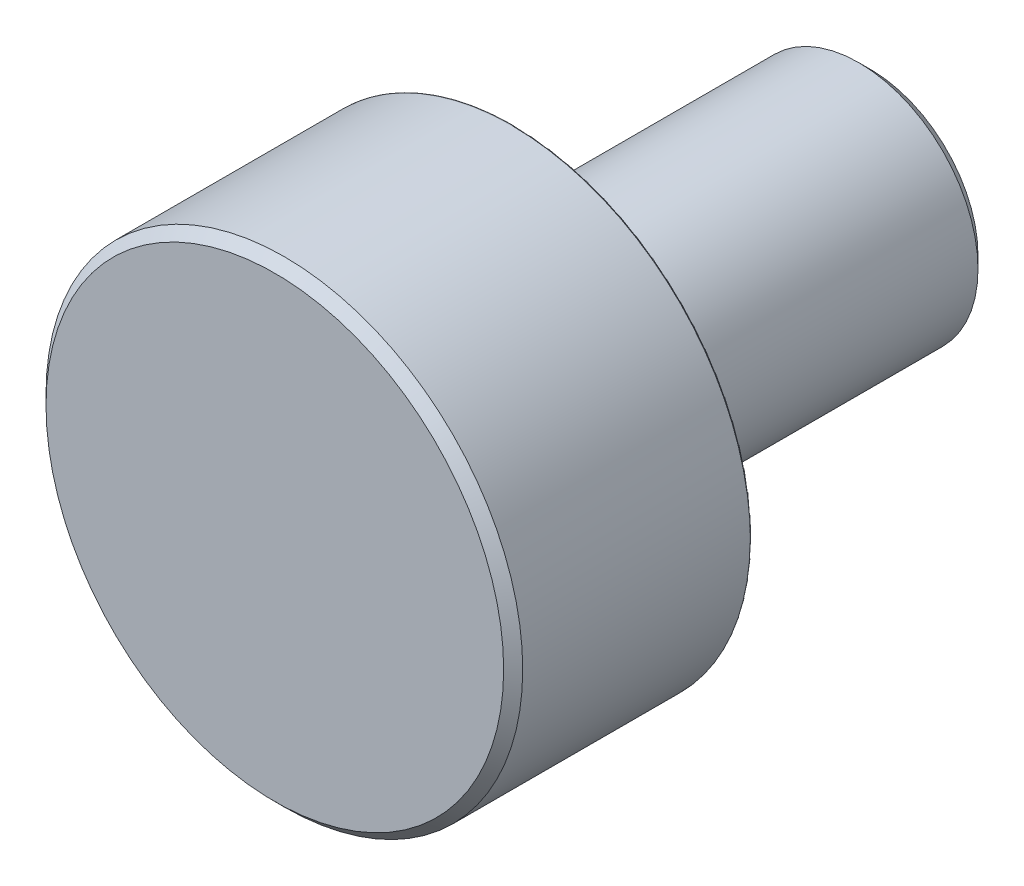
ISO-10303-21;
HEADER;
FILE_DESCRIPTION(('STEP AP214'),'2;1');
FILE_NAME('part.step','',(''),(''),'','','');
FILE_SCHEMA(('AUTOMOTIVE_DESIGN { 1 0 10303 214 1 1 1 1 }'));
ENDSEC;
DATA;
#1=APPLICATION_CONTEXT('core data for automotive mechanical design processes');
#2=APPLICATION_PROTOCOL_DEFINITION('international standard','automotive_design',2000,#1);
#3=PRODUCT_CONTEXT('',#1,'mechanical');
#4=PRODUCT('Part','Part','',(#3));
#5=PRODUCT_RELATED_PRODUCT_CATEGORY('part','',(#4));
#6=PRODUCT_DEFINITION_FORMATION('','',#4);
#7=PRODUCT_DEFINITION_CONTEXT('part definition',#1,'design');
#8=PRODUCT_DEFINITION('design','',#6,#7);
#9=PRODUCT_DEFINITION_SHAPE('','',#8);
#10=(LENGTH_UNIT() NAMED_UNIT(*) SI_UNIT(.MILLI.,.METRE.));
#11=(NAMED_UNIT(*) PLANE_ANGLE_UNIT() SI_UNIT($,.RADIAN.));
#12=(NAMED_UNIT(*) SI_UNIT($,.STERADIAN.) SOLID_ANGLE_UNIT());
#13=UNCERTAINTY_MEASURE_WITH_UNIT(LENGTH_MEASURE(1.E-05),#10,'distance_accuracy_value','');
#14=(GEOMETRIC_REPRESENTATION_CONTEXT(3) GLOBAL_UNCERTAINTY_ASSIGNED_CONTEXT((#13)) GLOBAL_UNIT_ASSIGNED_CONTEXT((#10,
#11,#12)) REPRESENTATION_CONTEXT('',''));
#15=CARTESIAN_POINT('',(0.,0.,0.));
#16=DIRECTION('',(0.,0.,1.));
#17=DIRECTION('',(1.,0.,0.));
#18=AXIS2_PLACEMENT_3D('',#15,#16,#17);
#19=CARTESIAN_POINT('',(0.,0.,8.00000000000001));
#20=DIRECTION('',(0.,0.,-1.));
#21=DIRECTION('',(-1.,0.,0.));
#22=AXIS2_PLACEMENT_3D('',#19,#20,#21);
#23=PLANE('',#22);
#24=CARTESIAN_POINT('',(0.,0.,8.00000000000001));
#25=DIRECTION('',(0.,0.,-1.));
#26=DIRECTION('',(-1.,0.,0.));
#27=AXIS2_PLACEMENT_3D('',#24,#25,#26);
#28=CIRCLE('',#27,7.68000000000001);
#29=CARTESIAN_POINT('',(-7.68000000000001,0.,8.00000000000001));
#30=VERTEX_POINT('',#29);
#31=EDGE_CURVE('E54',#30,#30,#28,.F.);
#32=ORIENTED_EDGE('',*,*,#31,.T.);
#33=EDGE_LOOP('',(#32));
#34=FACE_BOUND('',#33,.T.);
#35=ADVANCED_FACE('F39',(#34),#23,.F.);
#36=CARTESIAN_POINT('',(0.,0.,12.7));
#37=DIRECTION('',(0.,0.,1.));
#38=DIRECTION('',(1.,0.,0.));
#39=AXIS2_PLACEMENT_3D('',#36,#37,#38);
#40=CYLINDRICAL_SURFACE('',#39,8.);
#41=CARTESIAN_POINT('',(0.,0.,7.67999999999999));
#42=DIRECTION('',(0.,0.,-1.));
#43=DIRECTION('',(-1.,0.,0.));
#44=AXIS2_PLACEMENT_3D('',#41,#42,#43);
#45=CIRCLE('',#44,8.);
#46=CARTESIAN_POINT('',(-8.,0.,7.67999999999999));
#47=VERTEX_POINT('',#46);
#48=EDGE_CURVE('E50',#47,#47,#45,.T.);
#49=ORIENTED_EDGE('',*,*,#48,.T.);
#50=EDGE_LOOP('',(#49));
#51=FACE_BOUND('',#50,.T.);
#52=CARTESIAN_POINT('',(0.,0.,0.0499999999999945));
#53=DIRECTION('',(0.,0.,1.));
#54=DIRECTION('',(1.,0.,0.));
#55=AXIS2_PLACEMENT_3D('',#52,#53,#54);
#56=CIRCLE('',#55,8.);
#57=CARTESIAN_POINT('',(8.,0.,0.0499999999999945));
#58=VERTEX_POINT('',#57);
#59=EDGE_CURVE('E59',#58,#58,#56,.T.);
#60=ORIENTED_EDGE('',*,*,#59,.T.);
#61=EDGE_LOOP('',(#60));
#62=FACE_BOUND('',#61,.T.);
#63=ADVANCED_FACE('F97',(#51,#62),#40,.T.);
#64=CARTESIAN_POINT('',(0.,0.,0.0499999999999945));
#65=DIRECTION('',(0.,0.,1.));
#66=DIRECTION('',(1.,0.,0.));
#67=AXIS2_PLACEMENT_3D('',#64,#65,#66);
#68=TOROIDAL_SURFACE('',#67,7.95,0.0499999999999998);
#69=ORIENTED_EDGE('',*,*,#59,.F.);
#70=EDGE_LOOP('',(#69));
#71=FACE_BOUND('',#70,.T.);
#72=CARTESIAN_POINT('',(0.,0.,0.));
#73=DIRECTION('',(0.,0.,1.));
#74=DIRECTION('',(1.,0.,0.));
#75=AXIS2_PLACEMENT_3D('',#72,#73,#74);
#76=CIRCLE('',#75,7.95);
#77=CARTESIAN_POINT('',(7.95,0.,0.));
#78=VERTEX_POINT('',#77);
#79=EDGE_CURVE('E62',#78,#78,#76,.T.);
#80=ORIENTED_EDGE('',*,*,#79,.T.);
#81=EDGE_LOOP('',(#80));
#82=FACE_BOUND('',#81,.T.);
#83=ADVANCED_FACE('F103',(#71,#82),#68,.T.);
#84=CARTESIAN_POINT('',(0.,7.95000000000001,0.));
#85=DIRECTION('',(0.,0.,1.));
#86=DIRECTION('',(1.,0.,0.));
#87=AXIS2_PLACEMENT_3D('',#84,#85,#86);
#88=PLANE('',#87);
#89=ORIENTED_EDGE('',*,*,#79,.F.);
#90=EDGE_LOOP('',(#89));
#91=FACE_BOUND('',#90,.T.);
#92=CARTESIAN_POINT('',(0.,0.,0.));
#93=DIRECTION('',(0.,0.,1.));
#94=DIRECTION('',(1.,0.,0.));
#95=AXIS2_PLACEMENT_3D('',#92,#93,#94);
#96=CIRCLE('',#95,4.44721359549996);
#97=CARTESIAN_POINT('',(4.44721359549996,0.,0.));
#98=VERTEX_POINT('',#97);
#99=EDGE_CURVE('E65',#98,#98,#96,.T.);
#100=ORIENTED_EDGE('',*,*,#99,.T.);
#101=EDGE_LOOP('',(#100));
#102=FACE_BOUND('',#101,.T.);
#103=ADVANCED_FACE('F121',(#91,#102),#88,.F.);
#104=CARTESIAN_POINT('',(0.,0.,0.0499999999999945));
#105=DIRECTION('',(0.,0.,1.));
#106=DIRECTION('',(1.,0.,0.));
#107=AXIS2_PLACEMENT_3D('',#104,#105,#106);
#108=TOROIDAL_SURFACE('',#107,4.44721359549996,0.0499999999999996);
#109=ORIENTED_EDGE('',*,*,#99,.F.);
#110=EDGE_LOOP('',(#109));
#111=FACE_BOUND('',#110,.T.);
#112=CARTESIAN_POINT('',(0.,0.,0.0444444444444303));
#113=DIRECTION('',(0.,0.,1.));
#114=DIRECTION('',(1.,0.,0.));
#115=AXIS2_PLACEMENT_3D('',#112,#113,#114);
#116=CIRCLE('',#115,4.39752319599996);
#117=CARTESIAN_POINT('',(4.39752319599996,0.,0.0444444444444303));
#118=VERTEX_POINT('',#117);
#119=EDGE_CURVE('E68',#118,#118,#116,.T.);
#120=ORIENTED_EDGE('',*,*,#119,.T.);
#121=EDGE_LOOP('',(#120));
#122=FACE_BOUND('',#121,.T.);
#123=ADVANCED_FACE('F126',(#111,#122),#108,.T.);
#124=CARTESIAN_POINT('',(0.,0.,0.));
#125=DIRECTION('',(0.,0.,1.));
#126=DIRECTION('',(1.,0.,0.));
#127=AXIS2_PLACEMENT_3D('',#124,#125,#126);
#128=TOROIDAL_SURFACE('',#127,4.,0.400000000000001);
#129=ORIENTED_EDGE('',*,*,#119,.F.);
#130=EDGE_LOOP('',(#129));
#131=FACE_BOUND('',#130,.T.);
#132=CARTESIAN_POINT('',(0.,0.,0.));
#133=DIRECTION('',(0.,0.,1.));
#134=DIRECTION('',(1.,0.,0.));
#135=AXIS2_PLACEMENT_3D('',#132,#133,#134);
#136=CIRCLE('',#135,3.6);
#137=CARTESIAN_POINT('',(3.6,0.,0.));
#138=VERTEX_POINT('',#137);
#139=EDGE_CURVE('E71',#138,#138,#136,.T.);
#140=ORIENTED_EDGE('',*,*,#139,.T.);
#141=EDGE_LOOP('',(#140));
#142=FACE_BOUND('',#141,.T.);
#143=ADVANCED_FACE('F132',(#131,#142),#128,.F.);
#144=CARTESIAN_POINT('',(0.,0.,12.7));
#145=DIRECTION('',(0.,0.,1.));
#146=DIRECTION('',(1.,0.,0.));
#147=AXIS2_PLACEMENT_3D('',#144,#145,#146);
#148=CYLINDRICAL_SURFACE('',#147,3.6);
#149=ORIENTED_EDGE('',*,*,#139,.F.);
#150=EDGE_LOOP('',(#149));
#151=FACE_BOUND('',#150,.T.);
#152=CARTESIAN_POINT('',(0.,0.,-0.799999999999995));
#153=DIRECTION('',(0.,0.,1.));
#154=DIRECTION('',(1.,0.,0.));
#155=AXIS2_PLACEMENT_3D('',#152,#153,#154);
#156=CIRCLE('',#155,3.6);
#157=CARTESIAN_POINT('',(3.6,0.,-0.799999999999995));
#158=VERTEX_POINT('',#157);
#159=EDGE_CURVE('E74',#158,#158,#156,.T.);
#160=ORIENTED_EDGE('',*,*,#159,.T.);
#161=EDGE_LOOP('',(#160));
#162=FACE_BOUND('',#161,.T.);
#163=ADVANCED_FACE('F93',(#151,#162),#148,.T.);
#164=CARTESIAN_POINT('',(0.,3.60000000000007,-0.799999999999995));
#165=DIRECTION('',(0.,0.,-1.));
#166=DIRECTION('',(-1.,0.,0.));
#167=AXIS2_PLACEMENT_3D('',#164,#165,#166);
#168=PLANE('',#167);
#169=ORIENTED_EDGE('',*,*,#159,.F.);
#170=EDGE_LOOP('',(#169));
#171=FACE_BOUND('',#170,.T.);
#172=CARTESIAN_POINT('',(0.,0.,-0.799999999999995));
#173=DIRECTION('',(0.,0.,1.));
#174=DIRECTION('',(1.,0.,0.));
#175=AXIS2_PLACEMENT_3D('',#172,#173,#174);
#176=CIRCLE('',#175,4.);
#177=CARTESIAN_POINT('',(4.,0.,-0.799999999999995));
#178=VERTEX_POINT('',#177);
#179=EDGE_CURVE('E77',#178,#178,#176,.T.);
#180=ORIENTED_EDGE('',*,*,#179,.T.);
#181=EDGE_LOOP('',(#180));
#182=FACE_BOUND('',#181,.T.);
#183=ADVANCED_FACE('F81',(#171,#182),#168,.F.);
#184=CARTESIAN_POINT('',(0.,0.,12.7));
#185=DIRECTION('',(0.,0.,1.));
#186=DIRECTION('',(1.,0.,0.));
#187=AXIS2_PLACEMENT_3D('',#184,#185,#186);
#188=CYLINDRICAL_SURFACE('',#187,4.);
#189=CARTESIAN_POINT('',(0.,0.,-11.6000000000002));
#190=DIRECTION('',(0.,0.,1.));
#191=DIRECTION('',(1.,0.,0.));
#192=AXIS2_PLACEMENT_3D('',#189,#190,#191);
#193=CIRCLE('',#192,4.);
#194=CARTESIAN_POINT('',(4.,0.,-11.6000000000002));
#195=VERTEX_POINT('',#194);
#196=EDGE_CURVE('E46',#195,#195,#193,.T.);
#197=ORIENTED_EDGE('',*,*,#196,.T.);
#198=EDGE_LOOP('',(#197));
#199=FACE_BOUND('',#198,.T.);
#200=ORIENTED_EDGE('',*,*,#179,.F.);
#201=EDGE_LOOP('',(#200));
#202=FACE_BOUND('',#201,.T.);
#203=ADVANCED_FACE('F83',(#199,#202),#188,.T.);
#204=CARTESIAN_POINT('',(0.,4.,-12.0000000000001));
#205=DIRECTION('',(0.,0.,1.));
#206=DIRECTION('',(1.,0.,0.));
#207=AXIS2_PLACEMENT_3D('',#204,#205,#206);
#208=PLANE('',#207);
#209=CARTESIAN_POINT('',(0.,0.,-12.0000000000001));
#210=DIRECTION('',(0.,0.,1.));
#211=DIRECTION('',(1.,0.,0.));
#212=AXIS2_PLACEMENT_3D('',#209,#210,#211);
#213=CIRCLE('',#212,3.6);
#214=CARTESIAN_POINT('',(3.6,0.,-12.0000000000001));
#215=VERTEX_POINT('',#214);
#216=EDGE_CURVE('E10',#215,#215,#213,.F.);
#217=ORIENTED_EDGE('',*,*,#216,.T.);
#218=EDGE_LOOP('',(#217));
#219=FACE_BOUND('',#218,.T.);
#220=ADVANCED_FACE('F85',(#219),#208,.F.);
#221=CARTESIAN_POINT('',(0.,0.,8.00000000000001));
#222=DIRECTION('',(0.,0.,-1.));
#223=DIRECTION('',(-1.,0.,0.));
#224=AXIS2_PLACEMENT_3D('',#221,#222,#223);
#225=CONICAL_SURFACE('',#224,7.68000000000001,0.785398163397443);
#226=ORIENTED_EDGE('',*,*,#48,.F.);
#227=EDGE_LOOP('',(#226));
#228=FACE_BOUND('',#227,.T.);
#229=ORIENTED_EDGE('',*,*,#31,.F.);
#230=EDGE_LOOP('',(#229));
#231=FACE_BOUND('',#230,.T.);
#232=ADVANCED_FACE('F91',(#228,#231),#225,.T.);
#233=CARTESIAN_POINT('',(0.,0.,-11.6000000000002));
#234=DIRECTION('',(0.,0.,1.));
#235=DIRECTION('',(1.,0.,0.));
#236=AXIS2_PLACEMENT_3D('',#233,#234,#235);
#237=CONICAL_SURFACE('',#236,4.,0.785398163397448);
#238=ORIENTED_EDGE('',*,*,#216,.F.);
#239=EDGE_LOOP('',(#238));
#240=FACE_BOUND('',#239,.T.);
#241=ORIENTED_EDGE('',*,*,#196,.F.);
#242=EDGE_LOOP('',(#241));
#243=FACE_BOUND('',#242,.T.);
#244=ADVANCED_FACE('F41',(#240,#243),#237,.T.);
#245=CLOSED_SHELL('',(#35,#63,#83,#103,#123,#143,#163,#183,#203,#220,#232,#244));
#246=MANIFOLD_SOLID_BREP('B2',#245);
#247=ADVANCED_BREP_SHAPE_REPRESENTATION('',(#18,#246),#14);
#248=SHAPE_DEFINITION_REPRESENTATION(#9,#247);
ENDSEC;
END-ISO-10303-21;
